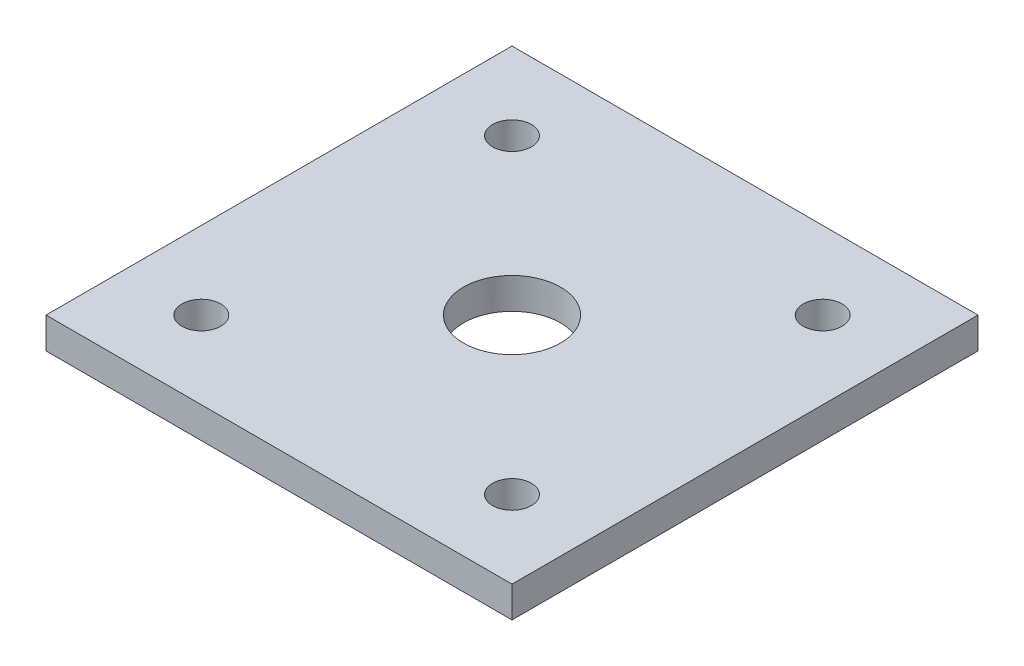
ISO-10303-21;
HEADER;
FILE_DESCRIPTION(('STEP AP214'),'2;1');
FILE_NAME('part.step','',(''),(''),'','','');
FILE_SCHEMA(('AUTOMOTIVE_DESIGN { 1 0 10303 214 1 1 1 1 }'));
ENDSEC;
DATA;
#1=APPLICATION_CONTEXT('core data for automotive mechanical design processes');
#2=APPLICATION_PROTOCOL_DEFINITION('international standard','automotive_design',2000,#1);
#3=PRODUCT_CONTEXT('',#1,'mechanical');
#4=PRODUCT('Part','Part','',(#3));
#5=PRODUCT_RELATED_PRODUCT_CATEGORY('part','',(#4));
#6=PRODUCT_DEFINITION_FORMATION('','',#4);
#7=PRODUCT_DEFINITION_CONTEXT('part definition',#1,'design');
#8=PRODUCT_DEFINITION('design','',#6,#7);
#9=PRODUCT_DEFINITION_SHAPE('','',#8);
#10=(LENGTH_UNIT() NAMED_UNIT(*) SI_UNIT(.MILLI.,.METRE.));
#11=(NAMED_UNIT(*) PLANE_ANGLE_UNIT() SI_UNIT($,.RADIAN.));
#12=(NAMED_UNIT(*) SI_UNIT($,.STERADIAN.) SOLID_ANGLE_UNIT());
#13=UNCERTAINTY_MEASURE_WITH_UNIT(LENGTH_MEASURE(1.E-05),#10,'distance_accuracy_value','');
#14=(GEOMETRIC_REPRESENTATION_CONTEXT(3) GLOBAL_UNCERTAINTY_ASSIGNED_CONTEXT((#13)) GLOBAL_UNIT_ASSIGNED_CONTEXT((#10,
#11,#12)) REPRESENTATION_CONTEXT('',''));
#15=CARTESIAN_POINT('',(0.,0.,0.));
#16=DIRECTION('',(0.,0.,1.));
#17=DIRECTION('',(1.,0.,0.));
#18=AXIS2_PLACEMENT_3D('',#15,#16,#17);
#19=CARTESIAN_POINT('',(40.,9.99999999999999,40.));
#20=DIRECTION('',(0.,-1.,0.));
#21=DIRECTION('',(0.,0.,-1.));
#22=AXIS2_PLACEMENT_3D('',#19,#20,#21);
#23=CYLINDRICAL_SURFACE('',#22,5.);
#24=CARTESIAN_POINT('',(40.,0.,40.));
#25=DIRECTION('',(0.,-1.,0.));
#26=DIRECTION('',(0.,0.,-1.));
#27=AXIS2_PLACEMENT_3D('',#24,#25,#26);
#28=CIRCLE('',#27,5.);
#29=CARTESIAN_POINT('',(40.,0.,35.));
#30=VERTEX_POINT('',#29);
#31=EDGE_CURVE('E48',#30,#30,#28,.T.);
#32=ORIENTED_EDGE('',*,*,#31,.T.);
#33=EDGE_LOOP('',(#32));
#34=FACE_BOUND('',#33,.T.);
#35=CARTESIAN_POINT('',(40.,8.,40.));
#36=DIRECTION('',(0.,-1.,0.));
#37=DIRECTION('',(0.,0.,-1.));
#38=AXIS2_PLACEMENT_3D('',#35,#36,#37);
#39=CIRCLE('',#38,5.);
#40=CARTESIAN_POINT('',(40.,8.,35.));
#41=VERTEX_POINT('',#40);
#42=EDGE_CURVE('E11',#41,#41,#39,.T.);
#43=ORIENTED_EDGE('',*,*,#42,.F.);
#44=EDGE_LOOP('',(#43));
#45=FACE_BOUND('',#44,.T.);
#46=ADVANCED_FACE('F39',(#34,#45),#23,.F.);
#47=CARTESIAN_POINT('',(40.,9.99999999999999,-40.));
#48=DIRECTION('',(0.,-1.,0.));
#49=DIRECTION('',(0.,0.,-1.));
#50=AXIS2_PLACEMENT_3D('',#47,#48,#49);
#51=CYLINDRICAL_SURFACE('',#50,5.);
#52=CARTESIAN_POINT('',(40.,0.,-40.));
#53=DIRECTION('',(0.,-1.,0.));
#54=DIRECTION('',(0.,0.,-1.));
#55=AXIS2_PLACEMENT_3D('',#52,#53,#54);
#56=CIRCLE('',#55,5.);
#57=CARTESIAN_POINT('',(40.,0.,-45.));
#58=VERTEX_POINT('',#57);
#59=EDGE_CURVE('E129',#58,#58,#56,.T.);
#60=ORIENTED_EDGE('',*,*,#59,.T.);
#61=EDGE_LOOP('',(#60));
#62=FACE_BOUND('',#61,.T.);
#63=CARTESIAN_POINT('',(40.,8.,-40.));
#64=DIRECTION('',(0.,-1.,0.));
#65=DIRECTION('',(0.,0.,-1.));
#66=AXIS2_PLACEMENT_3D('',#63,#64,#65);
#67=CIRCLE('',#66,5.);
#68=CARTESIAN_POINT('',(40.,8.,-45.));
#69=VERTEX_POINT('',#68);
#70=EDGE_CURVE('E137',#69,#69,#67,.T.);
#71=ORIENTED_EDGE('',*,*,#70,.F.);
#72=EDGE_LOOP('',(#71));
#73=FACE_BOUND('',#72,.T.);
#74=ADVANCED_FACE('F165',(#62,#73),#51,.F.);
#75=CARTESIAN_POINT('',(60.,8.,-60.));
#76=DIRECTION('',(0.,0.,1.));
#77=DIRECTION('',(1.,0.,0.));
#78=AXIS2_PLACEMENT_3D('',#75,#76,#77);
#79=PLANE('',#78);
#80=DIRECTION('',(-1.,0.,0.));
#81=VECTOR('',#80,1.);
#82=CARTESIAN_POINT('',(60.,0.,-60.));
#83=LINE('',#82,#81);
#84=CARTESIAN_POINT('',(60.,0.,-60.));
#85=VERTEX_POINT('',#84);
#86=CARTESIAN_POINT('',(-60.,0.,-60.));
#87=VERTEX_POINT('',#86);
#88=EDGE_CURVE('E111',#85,#87,#83,.T.);
#89=ORIENTED_EDGE('',*,*,#88,.T.);
#90=DIRECTION('',(0.,-1.,0.));
#91=VECTOR('',#90,1.);
#92=CARTESIAN_POINT('',(-60.,8.,-60.));
#93=LINE('',#92,#91);
#94=CARTESIAN_POINT('',(-60.,8.,-60.));
#95=VERTEX_POINT('',#94);
#96=EDGE_CURVE('E96',#95,#87,#93,.T.);
#97=ORIENTED_EDGE('',*,*,#96,.F.);
#98=DIRECTION('',(-1.,0.,0.));
#99=VECTOR('',#98,1.);
#100=CARTESIAN_POINT('',(60.,8.,-60.));
#101=LINE('',#100,#99);
#102=CARTESIAN_POINT('',(60.,8.,-60.));
#103=VERTEX_POINT('',#102);
#104=EDGE_CURVE('E80',#103,#95,#101,.T.);
#105=ORIENTED_EDGE('',*,*,#104,.F.);
#106=DIRECTION('',(0.,-1.,0.));
#107=VECTOR('',#106,1.);
#108=CARTESIAN_POINT('',(60.,8.,-60.));
#109=LINE('',#108,#107);
#110=EDGE_CURVE('E107',#103,#85,#109,.T.);
#111=ORIENTED_EDGE('',*,*,#110,.T.);
#112=EDGE_LOOP('',(#89,#97,#105,#111));
#113=FACE_BOUND('',#112,.T.);
#114=ADVANCED_FACE('F169',(#113),#79,.F.);
#115=CARTESIAN_POINT('',(-60.,8.,60.));
#116=DIRECTION('',(-1.,0.,0.));
#117=DIRECTION('',(0.,0.,1.));
#118=AXIS2_PLACEMENT_3D('',#115,#116,#117);
#119=PLANE('',#118);
#120=DIRECTION('',(0.,0.,-1.));
#121=VECTOR('',#120,1.);
#122=CARTESIAN_POINT('',(-60.,0.,60.));
#123=LINE('',#122,#121);
#124=CARTESIAN_POINT('',(-60.,0.,60.));
#125=VERTEX_POINT('',#124);
#126=EDGE_CURVE('E90',#125,#87,#123,.T.);
#127=ORIENTED_EDGE('',*,*,#126,.F.);
#128=DIRECTION('',(0.,-1.,0.));
#129=VECTOR('',#128,1.);
#130=CARTESIAN_POINT('',(-60.,8.,60.));
#131=LINE('',#130,#129);
#132=CARTESIAN_POINT('',(-60.,8.,60.));
#133=VERTEX_POINT('',#132);
#134=EDGE_CURVE('E86',#133,#125,#131,.T.);
#135=ORIENTED_EDGE('',*,*,#134,.F.);
#136=DIRECTION('',(0.,0.,-1.));
#137=VECTOR('',#136,1.);
#138=CARTESIAN_POINT('',(-60.,8.,60.));
#139=LINE('',#138,#137);
#140=EDGE_CURVE('E88',#133,#95,#139,.T.);
#141=ORIENTED_EDGE('',*,*,#140,.T.);
#142=ORIENTED_EDGE('',*,*,#96,.T.);
#143=EDGE_LOOP('',(#127,#135,#141,#142));
#144=FACE_BOUND('',#143,.T.);
#145=ADVANCED_FACE('F87',(#144),#119,.T.);
#146=CARTESIAN_POINT('',(60.,8.,60.));
#147=DIRECTION('',(0.,0.,1.));
#148=DIRECTION('',(1.,0.,0.));
#149=AXIS2_PLACEMENT_3D('',#146,#147,#148);
#150=PLANE('',#149);
#151=DIRECTION('',(-1.,0.,0.));
#152=VECTOR('',#151,1.);
#153=CARTESIAN_POINT('',(60.,0.,60.));
#154=LINE('',#153,#152);
#155=CARTESIAN_POINT('',(60.,0.,60.));
#156=VERTEX_POINT('',#155);
#157=EDGE_CURVE('E118',#156,#125,#154,.T.);
#158=ORIENTED_EDGE('',*,*,#157,.F.);
#159=DIRECTION('',(0.,-1.,0.));
#160=VECTOR('',#159,1.);
#161=CARTESIAN_POINT('',(60.,8.,60.));
#162=LINE('',#161,#160);
#163=CARTESIAN_POINT('',(60.,8.,60.));
#164=VERTEX_POINT('',#163);
#165=EDGE_CURVE('E72',#164,#156,#162,.T.);
#166=ORIENTED_EDGE('',*,*,#165,.F.);
#167=DIRECTION('',(-1.,0.,0.));
#168=VECTOR('',#167,1.);
#169=CARTESIAN_POINT('',(60.,8.,60.));
#170=LINE('',#169,#168);
#171=EDGE_CURVE('E100',#164,#133,#170,.T.);
#172=ORIENTED_EDGE('',*,*,#171,.T.);
#173=ORIENTED_EDGE('',*,*,#134,.T.);
#174=EDGE_LOOP('',(#158,#166,#172,#173));
#175=FACE_BOUND('',#174,.T.);
#176=ADVANCED_FACE('F103',(#175),#150,.T.);
#177=CARTESIAN_POINT('',(60.,8.,60.));
#178=DIRECTION('',(-1.,0.,0.));
#179=DIRECTION('',(0.,0.,1.));
#180=AXIS2_PLACEMENT_3D('',#177,#178,#179);
#181=PLANE('',#180);
#182=DIRECTION('',(0.,0.,-1.));
#183=VECTOR('',#182,1.);
#184=CARTESIAN_POINT('',(60.,0.,60.));
#185=LINE('',#184,#183);
#186=EDGE_CURVE('E75',#156,#85,#185,.T.);
#187=ORIENTED_EDGE('',*,*,#186,.T.);
#188=ORIENTED_EDGE('',*,*,#110,.F.);
#189=DIRECTION('',(0.,0.,-1.));
#190=VECTOR('',#189,1.);
#191=CARTESIAN_POINT('',(60.,8.,60.));
#192=LINE('',#191,#190);
#193=EDGE_CURVE('E56',#164,#103,#192,.T.);
#194=ORIENTED_EDGE('',*,*,#193,.F.);
#195=ORIENTED_EDGE('',*,*,#165,.T.);
#196=EDGE_LOOP('',(#187,#188,#194,#195));
#197=FACE_BOUND('',#196,.T.);
#198=ADVANCED_FACE('F158',(#197),#181,.F.);
#199=CARTESIAN_POINT('',(0.,8.,0.));
#200=DIRECTION('',(0.,-1.,0.));
#201=DIRECTION('',(0.,0.,-1.));
#202=AXIS2_PLACEMENT_3D('',#199,#200,#201);
#203=PLANE('',#202);
#204=CARTESIAN_POINT('',(-40.,8.,40.));
#205=DIRECTION('',(0.,-1.,0.));
#206=DIRECTION('',(0.,0.,-1.));
#207=AXIS2_PLACEMENT_3D('',#204,#205,#206);
#208=CIRCLE('',#207,5.);
#209=CARTESIAN_POINT('',(-40.,8.,35.));
#210=VERTEX_POINT('',#209);
#211=EDGE_CURVE('E245',#210,#210,#208,.T.);
#212=ORIENTED_EDGE('',*,*,#211,.T.);
#213=EDGE_LOOP('',(#212));
#214=FACE_BOUND('',#213,.T.);
#215=CARTESIAN_POINT('',(-40.,8.,-40.));
#216=DIRECTION('',(0.,-1.,0.));
#217=DIRECTION('',(0.,0.,-1.));
#218=AXIS2_PLACEMENT_3D('',#215,#216,#217);
#219=CIRCLE('',#218,5.);
#220=CARTESIAN_POINT('',(-40.,8.,-45.));
#221=VERTEX_POINT('',#220);
#222=EDGE_CURVE('E237',#221,#221,#219,.T.);
#223=ORIENTED_EDGE('',*,*,#222,.T.);
#224=EDGE_LOOP('',(#223));
#225=FACE_BOUND('',#224,.T.);
#226=CARTESIAN_POINT('',(0.,8.,0.));
#227=DIRECTION('',(0.,1.,0.));
#228=DIRECTION('',(0.,0.,1.));
#229=AXIS2_PLACEMENT_3D('',#226,#227,#228);
#230=CIRCLE('',#229,12.5);
#231=CARTESIAN_POINT('',(0.,8.,12.5));
#232=VERTEX_POINT('',#231);
#233=EDGE_CURVE('E133',#232,#232,#230,.T.);
#234=ORIENTED_EDGE('',*,*,#233,.F.);
#235=EDGE_LOOP('',(#234));
#236=FACE_BOUND('',#235,.T.);
#237=ORIENTED_EDGE('',*,*,#104,.T.);
#238=ORIENTED_EDGE('',*,*,#140,.F.);
#239=ORIENTED_EDGE('',*,*,#171,.F.);
#240=ORIENTED_EDGE('',*,*,#193,.T.);
#241=EDGE_LOOP('',(#237,#238,#239,#240));
#242=FACE_BOUND('',#241,.T.);
#243=ORIENTED_EDGE('',*,*,#70,.T.);
#244=EDGE_LOOP('',(#243));
#245=FACE_BOUND('',#244,.T.);
#246=ORIENTED_EDGE('',*,*,#42,.T.);
#247=EDGE_LOOP('',(#246));
#248=FACE_BOUND('',#247,.T.);
#249=ADVANCED_FACE('F98',(#214,#225,#236,#242,#245,#248),#203,.F.);
#250=CARTESIAN_POINT('',(0.,0.,0.));
#251=DIRECTION('',(0.,-1.,0.));
#252=DIRECTION('',(0.,0.,-1.));
#253=AXIS2_PLACEMENT_3D('',#250,#251,#252);
#254=PLANE('',#253);
#255=CARTESIAN_POINT('',(-40.,0.,40.));
#256=DIRECTION('',(0.,-1.,0.));
#257=DIRECTION('',(0.,0.,-1.));
#258=AXIS2_PLACEMENT_3D('',#255,#256,#257);
#259=CIRCLE('',#258,5.);
#260=CARTESIAN_POINT('',(-40.,0.,35.));
#261=VERTEX_POINT('',#260);
#262=EDGE_CURVE('E252',#261,#261,#259,.T.);
#263=ORIENTED_EDGE('',*,*,#262,.F.);
#264=EDGE_LOOP('',(#263));
#265=FACE_BOUND('',#264,.T.);
#266=CARTESIAN_POINT('',(-40.,0.,-40.));
#267=DIRECTION('',(0.,-1.,0.));
#268=DIRECTION('',(0.,0.,-1.));
#269=AXIS2_PLACEMENT_3D('',#266,#267,#268);
#270=CIRCLE('',#269,5.);
#271=CARTESIAN_POINT('',(-40.,0.,-45.));
#272=VERTEX_POINT('',#271);
#273=EDGE_CURVE('E234',#272,#272,#270,.T.);
#274=ORIENTED_EDGE('',*,*,#273,.F.);
#275=EDGE_LOOP('',(#274));
#276=FACE_BOUND('',#275,.T.);
#277=CARTESIAN_POINT('',(0.,0.,0.));
#278=DIRECTION('',(0.,-1.,0.));
#279=DIRECTION('',(0.,0.,-1.));
#280=AXIS2_PLACEMENT_3D('',#277,#278,#279);
#281=CIRCLE('',#280,12.5);
#282=CARTESIAN_POINT('',(0.,0.,-12.5));
#283=VERTEX_POINT('',#282);
#284=EDGE_CURVE('E115',#283,#283,#281,.T.);
#285=ORIENTED_EDGE('',*,*,#284,.F.);
#286=EDGE_LOOP('',(#285));
#287=FACE_BOUND('',#286,.T.);
#288=ORIENTED_EDGE('',*,*,#88,.F.);
#289=ORIENTED_EDGE('',*,*,#186,.F.);
#290=ORIENTED_EDGE('',*,*,#157,.T.);
#291=ORIENTED_EDGE('',*,*,#126,.T.);
#292=EDGE_LOOP('',(#288,#289,#290,#291));
#293=FACE_BOUND('',#292,.T.);
#294=ORIENTED_EDGE('',*,*,#59,.F.);
#295=EDGE_LOOP('',(#294));
#296=FACE_BOUND('',#295,.T.);
#297=ORIENTED_EDGE('',*,*,#31,.F.);
#298=EDGE_LOOP('',(#297));
#299=FACE_BOUND('',#298,.T.);
#300=ADVANCED_FACE('F146',(#265,#276,#287,#293,#296,#299),#254,.T.);
#301=CARTESIAN_POINT('',(0.,-1.99999999999999,0.));
#302=DIRECTION('',(0.,1.,0.));
#303=DIRECTION('',(0.,0.,1.));
#304=AXIS2_PLACEMENT_3D('',#301,#302,#303);
#305=CYLINDRICAL_SURFACE('',#304,12.5);
#306=ORIENTED_EDGE('',*,*,#284,.T.);
#307=EDGE_LOOP('',(#306));
#308=FACE_BOUND('',#307,.T.);
#309=ORIENTED_EDGE('',*,*,#233,.T.);
#310=EDGE_LOOP('',(#309));
#311=FACE_BOUND('',#310,.T.);
#312=ADVANCED_FACE('F148',(#308,#311),#305,.F.);
#313=CARTESIAN_POINT('',(-40.,9.99999999999999,-40.));
#314=DIRECTION('',(0.,-1.,0.));
#315=DIRECTION('',(0.,0.,-1.));
#316=AXIS2_PLACEMENT_3D('',#313,#314,#315);
#317=CYLINDRICAL_SURFACE('',#316,5.);
#318=ORIENTED_EDGE('',*,*,#273,.T.);
#319=EDGE_LOOP('',(#318));
#320=FACE_BOUND('',#319,.T.);
#321=ORIENTED_EDGE('',*,*,#222,.F.);
#322=EDGE_LOOP('',(#321));
#323=FACE_BOUND('',#322,.T.);
#324=ADVANCED_FACE('F155',(#320,#323),#317,.F.);
#325=CARTESIAN_POINT('',(-40.,9.99999999999999,40.));
#326=DIRECTION('',(0.,-1.,0.));
#327=DIRECTION('',(0.,0.,-1.));
#328=AXIS2_PLACEMENT_3D('',#325,#326,#327);
#329=CYLINDRICAL_SURFACE('',#328,5.);
#330=ORIENTED_EDGE('',*,*,#262,.T.);
#331=EDGE_LOOP('',(#330));
#332=FACE_BOUND('',#331,.T.);
#333=ORIENTED_EDGE('',*,*,#211,.F.);
#334=EDGE_LOOP('',(#333));
#335=FACE_BOUND('',#334,.T.);
#336=ADVANCED_FACE('F203',(#332,#335),#329,.F.);
#337=CLOSED_SHELL('',(#46,#74,#114,#145,#176,#198,#249,#300,#312,#324,#336));
#338=MANIFOLD_SOLID_BREP('B2',#337);
#339=ADVANCED_BREP_SHAPE_REPRESENTATION('',(#18,#338),#14);
#340=SHAPE_DEFINITION_REPRESENTATION(#9,#339);
ENDSEC;
END-ISO-10303-21;
